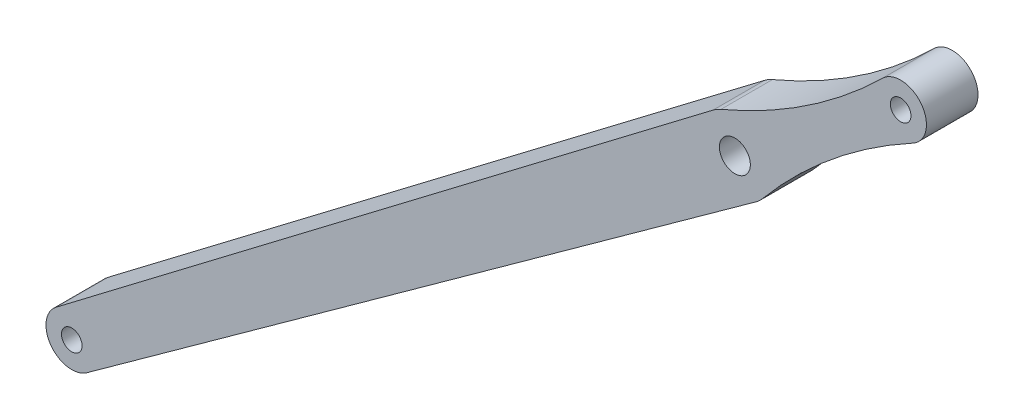
ISO-10303-21;
HEADER;
FILE_DESCRIPTION(('STEP AP214'),'2;1');
FILE_NAME('part.step','',(''),(''),'','','');
FILE_SCHEMA(('AUTOMOTIVE_DESIGN { 1 0 10303 214 1 1 1 1 }'));
ENDSEC;
DATA;
#1=APPLICATION_CONTEXT('core data for automotive mechanical design processes');
#2=APPLICATION_PROTOCOL_DEFINITION('international standard','automotive_design',2000,#1);
#3=PRODUCT_CONTEXT('',#1,'mechanical');
#4=PRODUCT('Part','Part','',(#3));
#5=PRODUCT_RELATED_PRODUCT_CATEGORY('part','',(#4));
#6=PRODUCT_DEFINITION_FORMATION('','',#4);
#7=PRODUCT_DEFINITION_CONTEXT('part definition',#1,'design');
#8=PRODUCT_DEFINITION('design','',#6,#7);
#9=PRODUCT_DEFINITION_SHAPE('','',#8);
#10=(LENGTH_UNIT() NAMED_UNIT(*) SI_UNIT(.MILLI.,.METRE.));
#11=(NAMED_UNIT(*) PLANE_ANGLE_UNIT() SI_UNIT($,.RADIAN.));
#12=(NAMED_UNIT(*) SI_UNIT($,.STERADIAN.) SOLID_ANGLE_UNIT());
#13=UNCERTAINTY_MEASURE_WITH_UNIT(LENGTH_MEASURE(1.E-05),#10,'distance_accuracy_value','');
#14=(GEOMETRIC_REPRESENTATION_CONTEXT(3) GLOBAL_UNCERTAINTY_ASSIGNED_CONTEXT((#13)) GLOBAL_UNIT_ASSIGNED_CONTEXT((#10,
#11,#12)) REPRESENTATION_CONTEXT('',''));
#15=CARTESIAN_POINT('',(0.,0.,0.));
#16=DIRECTION('',(0.,0.,1.));
#17=DIRECTION('',(1.,0.,0.));
#18=AXIS2_PLACEMENT_3D('',#15,#16,#17);
#19=CARTESIAN_POINT('',(-95.9192323632557,133.006148355805,-5.));
#20=DIRECTION('',(-0.584926275694677,0.811086463949408,0.));
#21=DIRECTION('',(-0.811086463949408,-0.584926275694677,0.));
#22=AXIS2_PLACEMENT_3D('',#19,#20,#21);
#23=PLANE('',#22);
#24=DIRECTION('',(0.,0.,1.));
#25=VECTOR('',#24,1.);
#26=CARTESIAN_POINT('',(-98.2743948015099,131.307690232171,-5.));
#27=LINE('',#26,#25);
#28=CARTESIAN_POINT('',(-98.2743948015099,131.307690232171,-5.));
#29=VERTEX_POINT('',#28);
#30=CARTESIAN_POINT('',(-98.2743948015099,131.307690232171,5.));
#31=VERTEX_POINT('',#30);
#32=EDGE_CURVE('E38',#29,#31,#27,.T.);
#33=ORIENTED_EDGE('',*,*,#32,.T.);
#34=DIRECTION('',(-0.811086463949408,-0.584926275694677,0.));
#35=VECTOR('',#34,1.);
#36=CARTESIAN_POINT('',(-95.9192323632557,133.006148355805,5.));
#37=LINE('',#36,#35);
#38=CARTESIAN_POINT('',(-228.038090056547,37.7267979851001,5.));
#39=VERTEX_POINT('',#38);
#40=EDGE_CURVE('E103',#31,#39,#37,.T.);
#41=ORIENTED_EDGE('',*,*,#40,.T.);
#42=DIRECTION('',(0.,0.,1.));
#43=VECTOR('',#42,1.);
#44=CARTESIAN_POINT('',(-228.038090056547,37.7267979851001,-5.));
#45=LINE('',#44,#43);
#46=CARTESIAN_POINT('',(-228.038090056547,37.7267979851001,-5.));
#47=VERTEX_POINT('',#46);
#48=EDGE_CURVE('E11',#47,#39,#45,.T.);
#49=ORIENTED_EDGE('',*,*,#48,.F.);
#50=DIRECTION('',(-0.811086463949408,-0.584926275694677,0.));
#51=VECTOR('',#50,1.);
#52=CARTESIAN_POINT('',(-95.9192323632557,133.006148355805,-5.));
#53=LINE('',#52,#51);
#54=EDGE_CURVE('E51',#29,#47,#53,.T.);
#55=ORIENTED_EDGE('',*,*,#54,.F.);
#56=EDGE_LOOP('',(#33,#41,#49,#55));
#57=FACE_BOUND('',#56,.T.);
#58=ADVANCED_FACE('F35',(#57),#23,.F.);
#59=CARTESIAN_POINT('',(-230.96272143502,41.7822303048471,-5.));
#60=DIRECTION('',(0.,0.,1.));
#61=DIRECTION('',(1.,0.,0.));
#62=AXIS2_PLACEMENT_3D('',#59,#60,#61);
#63=CYLINDRICAL_SURFACE('',#62,4.99999999999999);
#64=ORIENTED_EDGE('',*,*,#48,.T.);
#65=CARTESIAN_POINT('',(-230.96272143502,41.7822303048471,5.));
#66=DIRECTION('',(0.,0.,1.));
#67=DIRECTION('',(1.,0.,0.));
#68=AXIS2_PLACEMENT_3D('',#65,#66,#67);
#69=CIRCLE('',#68,4.99999999999999);
#70=CARTESIAN_POINT('',(-233.987816753105,45.7632852299262,5.));
#71=VERTEX_POINT('',#70);
#72=EDGE_CURVE('E122',#71,#39,#69,.T.);
#73=ORIENTED_EDGE('',*,*,#72,.F.);
#74=DIRECTION('',(0.,0.,1.));
#75=VECTOR('',#74,1.);
#76=CARTESIAN_POINT('',(-233.987816753105,45.7632852299262,-5.));
#77=LINE('',#76,#75);
#78=CARTESIAN_POINT('',(-233.987816753105,45.7632852299262,-5.));
#79=VERTEX_POINT('',#78);
#80=EDGE_CURVE('E43',#79,#71,#77,.T.);
#81=ORIENTED_EDGE('',*,*,#80,.F.);
#82=CARTESIAN_POINT('',(-230.96272143502,41.7822303048471,-5.));
#83=DIRECTION('',(0.,0.,1.));
#84=DIRECTION('',(1.,0.,0.));
#85=AXIS2_PLACEMENT_3D('',#82,#83,#84);
#86=CIRCLE('',#85,4.99999999999999);
#87=EDGE_CURVE('E157',#79,#47,#86,.T.);
#88=ORIENTED_EDGE('',*,*,#87,.T.);
#89=EDGE_LOOP('',(#64,#73,#81,#88));
#90=FACE_BOUND('',#89,.T.);
#91=ADVANCED_FACE('F199',(#90),#63,.T.);
#92=CARTESIAN_POINT('',(-107.696007127363,141.728995123719,-5.));
#93=DIRECTION('',(-0.605019063617122,0.796210985015819,0.));
#94=DIRECTION('',(-0.796210985015819,-0.605019063617122,0.));
#95=AXIS2_PLACEMENT_3D('',#92,#93,#94);
#96=PLANE('',#95);
#97=ORIENTED_EDGE('',*,*,#80,.T.);
#98=DIRECTION('',(-0.796210985015819,-0.605019063617122,0.));
#99=VECTOR('',#98,1.);
#100=CARTESIAN_POINT('',(-107.696007127363,141.728995123719,5.));
#101=LINE('',#100,#99);
#102=CARTESIAN_POINT('',(-106.604012176692,142.558772374928,5.));
#103=VERTEX_POINT('',#102);
#104=EDGE_CURVE('E132',#103,#71,#101,.T.);
#105=ORIENTED_EDGE('',*,*,#104,.F.);
#106=DIRECTION('',(0.,0.,1.));
#107=VECTOR('',#106,1.);
#108=CARTESIAN_POINT('',(-106.604012176692,142.558772374928,-5.));
#109=LINE('',#108,#107);
#110=CARTESIAN_POINT('',(-106.604012176692,142.558772374928,-5.));
#111=VERTEX_POINT('',#110);
#112=EDGE_CURVE('E168',#111,#103,#109,.T.);
#113=ORIENTED_EDGE('',*,*,#112,.F.);
#114=DIRECTION('',(-0.796210985015819,-0.605019063617122,0.));
#115=VECTOR('',#114,1.);
#116=CARTESIAN_POINT('',(-107.696007127363,141.728995123719,-5.));
#117=LINE('',#116,#115);
#118=EDGE_CURVE('E155',#111,#79,#117,.T.);
#119=ORIENTED_EDGE('',*,*,#118,.T.);
#120=EDGE_LOOP('',(#97,#105,#113,#119));
#121=FACE_BOUND('',#120,.T.);
#122=ADVANCED_FACE('F195',(#121),#96,.T.);
#123=CARTESIAN_POINT('',(-102.368878731373,136.985295479817,-5.));
#124=DIRECTION('',(0.,0.,1.));
#125=DIRECTION('',(1.,0.,0.));
#126=AXIS2_PLACEMENT_3D('',#123,#124,#125);
#127=CYLINDRICAL_SURFACE('',#126,7.00000000000002);
#128=ORIENTED_EDGE('',*,*,#112,.T.);
#129=CARTESIAN_POINT('',(-102.368878731373,136.985295479817,5.));
#130=DIRECTION('',(0.,0.,1.));
#131=DIRECTION('',(1.,0.,0.));
#132=AXIS2_PLACEMENT_3D('',#129,#130,#131);
#133=CIRCLE('',#132,7.00000000000002);
#134=CARTESIAN_POINT('',(-105.085651054977,143.436585904353,5.));
#135=VERTEX_POINT('',#134);
#136=EDGE_CURVE('E117',#135,#103,#133,.T.);
#137=ORIENTED_EDGE('',*,*,#136,.F.);
#138=DIRECTION('',(0.,0.,1.));
#139=VECTOR('',#138,1.);
#140=CARTESIAN_POINT('',(-105.085651054977,143.436585904353,-5.));
#141=LINE('',#140,#139);
#142=CARTESIAN_POINT('',(-105.085651054977,143.436585904353,-5.));
#143=VERTEX_POINT('',#142);
#144=EDGE_CURVE('E170',#143,#135,#141,.T.);
#145=ORIENTED_EDGE('',*,*,#144,.F.);
#146=CARTESIAN_POINT('',(-102.368878731373,136.985295479817,-5.));
#147=DIRECTION('',(0.,0.,1.));
#148=DIRECTION('',(1.,0.,0.));
#149=AXIS2_PLACEMENT_3D('',#146,#147,#148);
#150=CIRCLE('',#149,7.00000000000002);
#151=EDGE_CURVE('E148',#143,#111,#150,.T.);
#152=ORIENTED_EDGE('',*,*,#151,.T.);
#153=EDGE_LOOP('',(#128,#137,#145,#152));
#154=FACE_BOUND('',#153,.T.);
#155=ADVANCED_FACE('F192',(#154),#127,.T.);
#156=CARTESIAN_POINT('',(-143.896684249318,235.597877683427,-5.));
#157=DIRECTION('',(0.,0.,1.));
#158=DIRECTION('',(1.,0.,0.));
#159=AXIS2_PLACEMENT_3D('',#156,#157,#158);
#160=CYLINDRICAL_SURFACE('',#159,100.);
#161=ORIENTED_EDGE('',*,*,#144,.T.);
#162=CARTESIAN_POINT('',(-143.896684249318,235.597877683427,5.));
#163=DIRECTION('',(0.,0.,1.));
#164=DIRECTION('',(1.,0.,0.));
#165=AXIS2_PLACEMENT_3D('',#162,#163,#164);
#166=CIRCLE('',#165,100.);
#167=CARTESIAN_POINT('',(-73.7288116837398,164.348529197839,5.));
#168=VERTEX_POINT('',#167);
#169=EDGE_CURVE('E129',#135,#168,#166,.T.);
#170=ORIENTED_EDGE('',*,*,#169,.T.);
#171=DIRECTION('',(0.,0.,1.));
#172=VECTOR('',#171,1.);
#173=CARTESIAN_POINT('',(-73.7288116837398,164.348529197839,-5.));
#174=LINE('',#173,#172);
#175=CARTESIAN_POINT('',(-73.7288116837398,164.348529197839,-5.));
#176=VERTEX_POINT('',#175);
#177=EDGE_CURVE('E172',#176,#168,#174,.T.);
#178=ORIENTED_EDGE('',*,*,#177,.F.);
#179=CARTESIAN_POINT('',(-143.896684249318,235.597877683427,-5.));
#180=DIRECTION('',(0.,0.,1.));
#181=DIRECTION('',(1.,0.,0.));
#182=AXIS2_PLACEMENT_3D('',#179,#180,#181);
#183=CIRCLE('',#182,100.);
#184=EDGE_CURVE('E153',#143,#176,#183,.T.);
#185=ORIENTED_EDGE('',*,*,#184,.F.);
#186=EDGE_LOOP('',(#161,#170,#178,#185));
#187=FACE_BOUND('',#186,.T.);
#188=ADVANCED_FACE('F186',(#187),#160,.F.);
#189=CARTESIAN_POINT('',(-70.2204180554608,160.78606177356,-5.));
#190=DIRECTION('',(0.,0.,1.));
#191=DIRECTION('',(1.,0.,0.));
#192=AXIS2_PLACEMENT_3D('',#189,#190,#191);
#193=CYLINDRICAL_SURFACE('',#192,4.99999999999999);
#194=ORIENTED_EDGE('',*,*,#177,.T.);
#195=CARTESIAN_POINT('',(-70.2204180554608,160.78606177356,5.));
#196=DIRECTION('',(0.,0.,1.));
#197=DIRECTION('',(1.,0.,0.));
#198=AXIS2_PLACEMENT_3D('',#195,#196,#197);
#199=CIRCLE('',#198,4.99999999999999);
#200=CARTESIAN_POINT('',(-67.8372205508388,156.390567528999,5.));
#201=VERTEX_POINT('',#200);
#202=EDGE_CURVE('E126',#201,#168,#199,.T.);
#203=ORIENTED_EDGE('',*,*,#202,.F.);
#204=DIRECTION('',(0.,0.,1.));
#205=VECTOR('',#204,1.);
#206=CARTESIAN_POINT('',(-67.8372205508388,156.390567528999,-5.));
#207=LINE('',#206,#205);
#208=CARTESIAN_POINT('',(-67.8372205508388,156.390567528999,-5.));
#209=VERTEX_POINT('',#208);
#210=EDGE_CURVE('E174',#209,#201,#207,.T.);
#211=ORIENTED_EDGE('',*,*,#210,.F.);
#212=CARTESIAN_POINT('',(-70.2204180554608,160.78606177356,-5.));
#213=DIRECTION('',(0.,0.,1.));
#214=DIRECTION('',(1.,0.,0.));
#215=AXIS2_PLACEMENT_3D('',#212,#213,#214);
#216=CIRCLE('',#215,4.99999999999999);
#217=EDGE_CURVE('E150',#209,#176,#216,.T.);
#218=ORIENTED_EDGE('',*,*,#217,.T.);
#219=EDGE_LOOP('',(#194,#203,#211,#218));
#220=FACE_BOUND('',#219,.T.);
#221=ADVANCED_FACE('F181',(#220),#193,.T.);
#222=CARTESIAN_POINT('',(-20.1732704583985,68.4806826377919,-5.));
#223=DIRECTION('',(0.,0.,1.));
#224=DIRECTION('',(1.,0.,0.));
#225=AXIS2_PLACEMENT_3D('',#222,#223,#224);
#226=CYLINDRICAL_SURFACE('',#225,100.);
#227=ORIENTED_EDGE('',*,*,#210,.T.);
#228=CARTESIAN_POINT('',(-20.1732704583985,68.4806826377919,5.));
#229=DIRECTION('',(0.,0.,1.));
#230=DIRECTION('',(1.,0.,0.));
#231=AXIS2_PLACEMENT_3D('',#228,#229,#230);
#232=CIRCLE('',#231,100.);
#233=CARTESIAN_POINT('',(-96.9915959471593,132.50368529389,5.));
#234=VERTEX_POINT('',#233);
#235=EDGE_CURVE('E115',#201,#234,#232,.T.);
#236=ORIENTED_EDGE('',*,*,#235,.T.);
#237=DIRECTION('',(0.,0.,1.));
#238=VECTOR('',#237,1.);
#239=CARTESIAN_POINT('',(-96.9915959471593,132.50368529389,-5.));
#240=LINE('',#239,#238);
#241=CARTESIAN_POINT('',(-96.9915959471593,132.50368529389,-5.));
#242=VERTEX_POINT('',#241);
#243=EDGE_CURVE('E106',#242,#234,#240,.T.);
#244=ORIENTED_EDGE('',*,*,#243,.F.);
#245=CARTESIAN_POINT('',(-20.1732704583985,68.4806826377919,-5.));
#246=DIRECTION('',(0.,0.,1.));
#247=DIRECTION('',(1.,0.,0.));
#248=AXIS2_PLACEMENT_3D('',#245,#246,#247);
#249=CIRCLE('',#248,100.);
#250=EDGE_CURVE('E147',#209,#242,#249,.T.);
#251=ORIENTED_EDGE('',*,*,#250,.F.);
#252=EDGE_LOOP('',(#227,#236,#244,#251));
#253=FACE_BOUND('',#252,.T.);
#254=ADVANCED_FACE('F178',(#253),#226,.F.);
#255=CARTESIAN_POINT('',(-102.368878731373,136.985295479817,-5.));
#256=DIRECTION('',(0.,0.,1.));
#257=DIRECTION('',(1.,0.,0.));
#258=AXIS2_PLACEMENT_3D('',#255,#256,#257);
#259=CYLINDRICAL_SURFACE('',#258,3.00000000000115);
#260=CARTESIAN_POINT('',(-102.368878731373,136.985295479817,-5.));
#261=DIRECTION('',(0.,0.,1.));
#262=DIRECTION('',(1.,0.,0.));
#263=AXIS2_PLACEMENT_3D('',#260,#261,#262);
#264=CIRCLE('',#263,3.00000000000115);
#265=CARTESIAN_POINT('',(-99.3688787313715,136.985295479817,-5.));
#266=VERTEX_POINT('',#265);
#267=EDGE_CURVE('E162',#266,#266,#264,.T.);
#268=ORIENTED_EDGE('',*,*,#267,.F.);
#269=EDGE_LOOP('',(#268));
#270=FACE_BOUND('',#269,.T.);
#271=CARTESIAN_POINT('',(-102.368878731373,136.985295479817,5.));
#272=DIRECTION('',(0.,0.,1.));
#273=DIRECTION('',(1.,0.,0.));
#274=AXIS2_PLACEMENT_3D('',#271,#272,#273);
#275=CIRCLE('',#274,3.00000000000115);
#276=CARTESIAN_POINT('',(-99.3688787313715,136.985295479817,5.));
#277=VERTEX_POINT('',#276);
#278=EDGE_CURVE('E138',#277,#277,#275,.T.);
#279=ORIENTED_EDGE('',*,*,#278,.T.);
#280=EDGE_LOOP('',(#279));
#281=FACE_BOUND('',#280,.T.);
#282=ADVANCED_FACE('F217',(#270,#281),#259,.F.);
#283=CARTESIAN_POINT('',(-230.96272143502,41.7822303048471,-5.));
#284=DIRECTION('',(0.,0.,1.));
#285=DIRECTION('',(1.,0.,0.));
#286=AXIS2_PLACEMENT_3D('',#283,#284,#285);
#287=CYLINDRICAL_SURFACE('',#286,1.99999999999997);
#288=CARTESIAN_POINT('',(-230.96272143502,41.7822303048471,-5.));
#289=DIRECTION('',(0.,0.,1.));
#290=DIRECTION('',(1.,0.,0.));
#291=AXIS2_PLACEMENT_3D('',#288,#289,#290);
#292=CIRCLE('',#291,1.99999999999997);
#293=CARTESIAN_POINT('',(-228.96272143502,41.7822303048471,-5.));
#294=VERTEX_POINT('',#293);
#295=EDGE_CURVE('E159',#294,#294,#292,.T.);
#296=ORIENTED_EDGE('',*,*,#295,.F.);
#297=EDGE_LOOP('',(#296));
#298=FACE_BOUND('',#297,.T.);
#299=CARTESIAN_POINT('',(-230.96272143502,41.7822303048471,5.));
#300=DIRECTION('',(0.,0.,1.));
#301=DIRECTION('',(1.,0.,0.));
#302=AXIS2_PLACEMENT_3D('',#299,#300,#301);
#303=CIRCLE('',#302,1.99999999999997);
#304=CARTESIAN_POINT('',(-228.96272143502,41.7822303048471,5.));
#305=VERTEX_POINT('',#304);
#306=EDGE_CURVE('E135',#305,#305,#303,.T.);
#307=ORIENTED_EDGE('',*,*,#306,.T.);
#308=EDGE_LOOP('',(#307));
#309=FACE_BOUND('',#308,.T.);
#310=ADVANCED_FACE('F208',(#298,#309),#287,.F.);
#311=ORIENTED_EDGE('',*,*,#243,.T.);
#312=EDGE_CURVE('E109',#31,#234,#133,.T.);
#313=ORIENTED_EDGE('',*,*,#312,.F.);
#314=ORIENTED_EDGE('',*,*,#32,.F.);
#315=EDGE_CURVE('E145',#29,#242,#150,.T.);
#316=ORIENTED_EDGE('',*,*,#315,.T.);
#317=EDGE_LOOP('',(#311,#313,#314,#316));
#318=FACE_BOUND('',#317,.T.);
#319=ADVANCED_FACE('F110',(#318),#127,.T.);
#320=CARTESIAN_POINT('',(-70.2204180554608,160.78606177356,-5.));
#321=DIRECTION('',(0.,0.,1.));
#322=DIRECTION('',(1.,0.,0.));
#323=AXIS2_PLACEMENT_3D('',#320,#321,#322);
#324=CYLINDRICAL_SURFACE('',#323,2.);
#325=CARTESIAN_POINT('',(-70.2204180554608,160.78606177356,-5.));
#326=DIRECTION('',(0.,0.,1.));
#327=DIRECTION('',(1.,0.,0.));
#328=AXIS2_PLACEMENT_3D('',#325,#326,#327);
#329=CIRCLE('',#328,2.);
#330=CARTESIAN_POINT('',(-68.2204180554608,160.78606177356,-5.));
#331=VERTEX_POINT('',#330);
#332=EDGE_CURVE('E107',#331,#331,#329,.T.);
#333=ORIENTED_EDGE('',*,*,#332,.F.);
#334=EDGE_LOOP('',(#333));
#335=FACE_BOUND('',#334,.T.);
#336=CARTESIAN_POINT('',(-70.2204180554608,160.78606177356,5.));
#337=DIRECTION('',(0.,0.,1.));
#338=DIRECTION('',(1.,0.,0.));
#339=AXIS2_PLACEMENT_3D('',#336,#337,#338);
#340=CIRCLE('',#339,2.);
#341=CARTESIAN_POINT('',(-68.2204180554608,160.78606177356,5.));
#342=VERTEX_POINT('',#341);
#343=EDGE_CURVE('E141',#342,#342,#340,.T.);
#344=ORIENTED_EDGE('',*,*,#343,.T.);
#345=EDGE_LOOP('',(#344));
#346=FACE_BOUND('',#345,.T.);
#347=ADVANCED_FACE('F229',(#335,#346),#324,.F.);
#348=CARTESIAN_POINT('',(0.,0.,-5.));
#349=DIRECTION('',(0.,0.,1.));
#350=DIRECTION('',(1.,0.,0.));
#351=AXIS2_PLACEMENT_3D('',#348,#349,#350);
#352=PLANE('',#351);
#353=ORIENTED_EDGE('',*,*,#54,.T.);
#354=ORIENTED_EDGE('',*,*,#87,.F.);
#355=ORIENTED_EDGE('',*,*,#118,.F.);
#356=ORIENTED_EDGE('',*,*,#151,.F.);
#357=ORIENTED_EDGE('',*,*,#184,.T.);
#358=ORIENTED_EDGE('',*,*,#217,.F.);
#359=ORIENTED_EDGE('',*,*,#250,.T.);
#360=ORIENTED_EDGE('',*,*,#315,.F.);
#361=EDGE_LOOP('',(#353,#354,#355,#356,#357,#358,#359,#360));
#362=FACE_BOUND('',#361,.T.);
#363=ORIENTED_EDGE('',*,*,#295,.T.);
#364=EDGE_LOOP('',(#363));
#365=FACE_BOUND('',#364,.T.);
#366=ORIENTED_EDGE('',*,*,#267,.T.);
#367=EDGE_LOOP('',(#366));
#368=FACE_BOUND('',#367,.T.);
#369=ORIENTED_EDGE('',*,*,#332,.T.);
#370=EDGE_LOOP('',(#369));
#371=FACE_BOUND('',#370,.T.);
#372=ADVANCED_FACE('F197',(#362,#365,#368,#371),#352,.F.);
#373=CARTESIAN_POINT('',(0.,0.,5.));
#374=DIRECTION('',(0.,0.,1.));
#375=DIRECTION('',(1.,0.,0.));
#376=AXIS2_PLACEMENT_3D('',#373,#374,#375);
#377=PLANE('',#376);
#378=ORIENTED_EDGE('',*,*,#40,.F.);
#379=ORIENTED_EDGE('',*,*,#312,.T.);
#380=ORIENTED_EDGE('',*,*,#235,.F.);
#381=ORIENTED_EDGE('',*,*,#202,.T.);
#382=ORIENTED_EDGE('',*,*,#169,.F.);
#383=ORIENTED_EDGE('',*,*,#136,.T.);
#384=ORIENTED_EDGE('',*,*,#104,.T.);
#385=ORIENTED_EDGE('',*,*,#72,.T.);
#386=EDGE_LOOP('',(#378,#379,#380,#381,#382,#383,#384,#385));
#387=FACE_BOUND('',#386,.T.);
#388=ORIENTED_EDGE('',*,*,#306,.F.);
#389=EDGE_LOOP('',(#388));
#390=FACE_BOUND('',#389,.T.);
#391=ORIENTED_EDGE('',*,*,#278,.F.);
#392=EDGE_LOOP('',(#391));
#393=FACE_BOUND('',#392,.T.);
#394=ORIENTED_EDGE('',*,*,#343,.F.);
#395=EDGE_LOOP('',(#394));
#396=FACE_BOUND('',#395,.T.);
#397=ADVANCED_FACE('F119',(#387,#390,#393,#396),#377,.T.);
#398=CLOSED_SHELL('',(#58,#91,#122,#155,#188,#221,#254,#282,#310,#319,#347,#372,#397));
#399=MANIFOLD_SOLID_BREP('B2',#398);
#400=ADVANCED_BREP_SHAPE_REPRESENTATION('',(#18,#399),#14);
#401=SHAPE_DEFINITION_REPRESENTATION(#9,#400);
ENDSEC;
END-ISO-10303-21;
